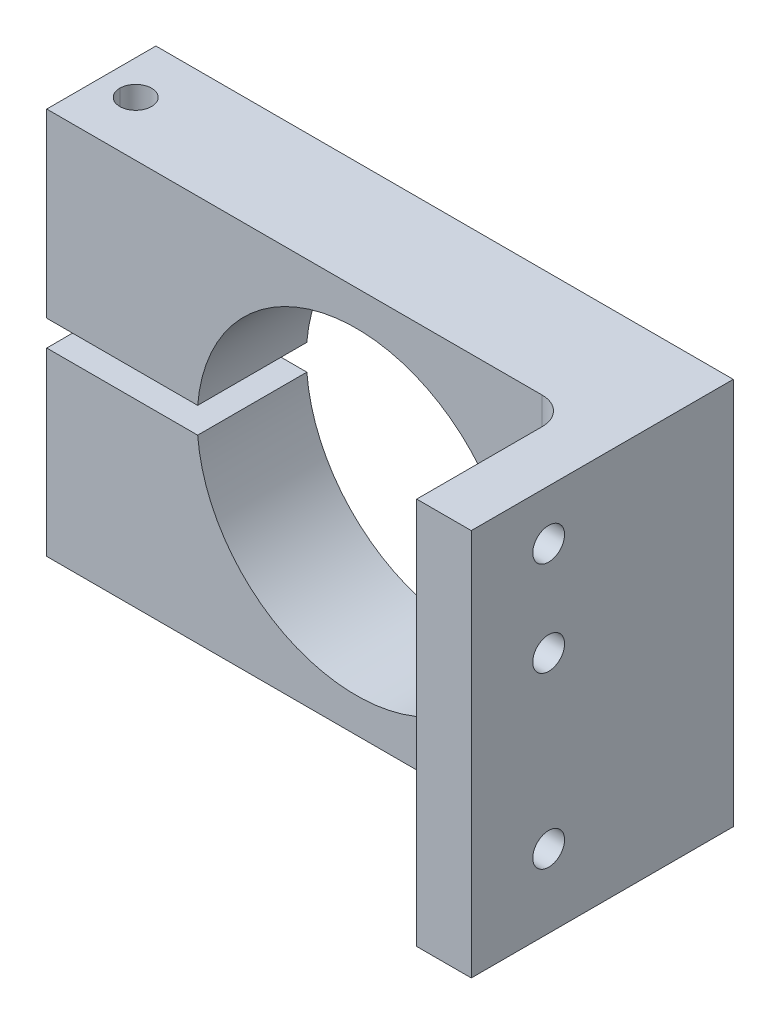
ISO-10303-21;
HEADER;
FILE_DESCRIPTION(('STEP AP214'),'2;1');
FILE_NAME('part.step','',(''),(''),'','','');
FILE_SCHEMA(('AUTOMOTIVE_DESIGN { 1 0 10303 214 1 1 1 1 }'));
ENDSEC;
DATA;
#1=APPLICATION_CONTEXT('core data for automotive mechanical design processes');
#2=APPLICATION_PROTOCOL_DEFINITION('international standard','automotive_design',2000,#1);
#3=PRODUCT_CONTEXT('',#1,'mechanical');
#4=PRODUCT('Part','Part','',(#3));
#5=PRODUCT_RELATED_PRODUCT_CATEGORY('part','',(#4));
#6=PRODUCT_DEFINITION_FORMATION('','',#4);
#7=PRODUCT_DEFINITION_CONTEXT('part definition',#1,'design');
#8=PRODUCT_DEFINITION('design','',#6,#7);
#9=PRODUCT_DEFINITION_SHAPE('','',#8);
#10=(LENGTH_UNIT() NAMED_UNIT(*) SI_UNIT(.MILLI.,.METRE.));
#11=(NAMED_UNIT(*) PLANE_ANGLE_UNIT() SI_UNIT($,.RADIAN.));
#12=(NAMED_UNIT(*) SI_UNIT($,.STERADIAN.) SOLID_ANGLE_UNIT());
#13=UNCERTAINTY_MEASURE_WITH_UNIT(LENGTH_MEASURE(1.E-05),#10,'distance_accuracy_value','');
#14=(GEOMETRIC_REPRESENTATION_CONTEXT(3) GLOBAL_UNCERTAINTY_ASSIGNED_CONTEXT((#13)) GLOBAL_UNIT_ASSIGNED_CONTEXT((#10,
#11,#12)) REPRESENTATION_CONTEXT('',''));
#15=CARTESIAN_POINT('',(0.,0.,0.));
#16=DIRECTION('',(0.,0.,1.));
#17=DIRECTION('',(1.,0.,0.));
#18=AXIS2_PLACEMENT_3D('',#15,#16,#17);
#19=CARTESIAN_POINT('',(11.1406749455796,0.114084600707214,0.400504127415024));
#20=DIRECTION('',(0.,0.,1.));
#21=DIRECTION('',(1.,0.,0.));
#22=AXIS2_PLACEMENT_3D('',#19,#20,#21);
#23=PLANE('',#22);
#24=DIRECTION('',(1.,0.,0.));
#25=VECTOR('',#24,1.);
#26=CARTESIAN_POINT('',(-24.8593250544204,-22.3859153992928,0.400504127415024));
#27=LINE('',#26,#25);
#28=CARTESIAN_POINT('',(-24.8593250544204,-22.3859153992928,0.400504127415024));
#29=VERTEX_POINT('',#28);
#30=CARTESIAN_POINT('',(32.7896749455796,-22.3859153992928,0.400504127415024));
#31=VERTEX_POINT('',#30);
#32=EDGE_CURVE('E282',#29,#31,#27,.T.);
#33=ORIENTED_EDGE('',*,*,#32,.T.);
#34=DIRECTION('',(0.,1.,0.));
#35=VECTOR('',#34,1.);
#36=CARTESIAN_POINT('',(32.7896749455796,0.114084600707207,0.400504127415024));
#37=LINE('',#36,#35);
#38=CARTESIAN_POINT('',(32.7896749455796,22.6940846007072,0.400504127415025));
#39=VERTEX_POINT('',#38);
#40=EDGE_CURVE('E317',#31,#39,#37,.T.);
#41=ORIENTED_EDGE('',*,*,#40,.T.);
#42=DIRECTION('',(1.,0.,0.));
#43=VECTOR('',#42,1.);
#44=CARTESIAN_POINT('',(-24.8593250544204,22.6940846007072,0.400504127415025));
#45=LINE('',#44,#43);
#46=CARTESIAN_POINT('',(-24.8593250544204,22.6940846007072,0.400504127415025));
#47=VERTEX_POINT('',#46);
#48=EDGE_CURVE('E221',#47,#39,#45,.T.);
#49=ORIENTED_EDGE('',*,*,#48,.F.);
#50=DIRECTION('',(0.,1.,0.));
#51=VECTOR('',#50,1.);
#52=CARTESIAN_POINT('',(-24.8593250544204,1.61408460070721,0.400504127415024));
#53=LINE('',#52,#51);
#54=CARTESIAN_POINT('',(-24.8593250544204,1.61408460070721,0.400504127415024));
#55=VERTEX_POINT('',#54);
#56=EDGE_CURVE('E324',#55,#47,#53,.T.);
#57=ORIENTED_EDGE('',*,*,#56,.F.);
#58=DIRECTION('',(-1.,0.,0.));
#59=VECTOR('',#58,1.);
#60=CARTESIAN_POINT('',(-11.2892247421141,1.61408460070721,0.400504127415024));
#61=LINE('',#60,#59);
#62=CARTESIAN_POINT('',(-7.2984139690062,1.61408460070721,0.400504127415024));
#63=VERTEX_POINT('',#62);
#64=EDGE_CURVE('E276',#63,#55,#61,.T.);
#65=ORIENTED_EDGE('',*,*,#64,.F.);
#66=CARTESIAN_POINT('',(11.1406749455796,0.114084600707214,0.400504127415024));
#67=DIRECTION('',(0.,0.,1.));
#68=DIRECTION('',(1.,0.,0.));
#69=AXIS2_PLACEMENT_3D('',#66,#67,#68);
#70=CIRCLE('',#69,18.5);
#71=CARTESIAN_POINT('',(29.6406749455796,0.114084600707214,0.400504127415024));
#72=VERTEX_POINT('',#71);
#73=EDGE_CURVE('E286',#72,#63,#70,.T.);
#74=ORIENTED_EDGE('',*,*,#73,.F.);
#75=CARTESIAN_POINT('',(11.1406749455796,0.114084600707214,0.400504127415024));
#76=DIRECTION('',(0.,0.,1.));
#77=DIRECTION('',(1.,0.,0.));
#78=AXIS2_PLACEMENT_3D('',#75,#76,#77);
#79=CIRCLE('',#78,18.5);
#80=CARTESIAN_POINT('',(-7.29841396900619,-1.38591539929284,0.400504127415024));
#81=VERTEX_POINT('',#80);
#82=EDGE_CURVE('E336',#81,#72,#79,.T.);
#83=ORIENTED_EDGE('',*,*,#82,.F.);
#84=DIRECTION('',(-1.,0.,0.));
#85=VECTOR('',#84,1.);
#86=CARTESIAN_POINT('',(-11.2892247421141,-1.38591539929279,0.400504127415024));
#87=LINE('',#86,#85);
#88=CARTESIAN_POINT('',(-24.8593250544204,-1.38591539929279,0.400504127415024));
#89=VERTEX_POINT('',#88);
#90=EDGE_CURVE('E281',#81,#89,#87,.T.);
#91=ORIENTED_EDGE('',*,*,#90,.T.);
#92=DIRECTION('',(0.,-1.,0.));
#93=VECTOR('',#92,1.);
#94=CARTESIAN_POINT('',(-24.8593250544204,-1.38591539929279,0.400504127415024));
#95=LINE('',#94,#93);
#96=EDGE_CURVE('E277',#89,#29,#95,.T.);
#97=ORIENTED_EDGE('',*,*,#96,.T.);
#98=EDGE_LOOP('',(#33,#41,#49,#57,#65,#74,#83,#91,#97));
#99=FACE_BOUND('',#98,.T.);
#100=ADVANCED_FACE('F66',(#99),#23,.T.);
#101=CARTESIAN_POINT('',(-24.8593250544204,-22.3859153992928,-12.299495872585));
#102=DIRECTION('',(0.,-1.,0.));
#103=DIRECTION('',(0.,0.,-1.));
#104=AXIS2_PLACEMENT_3D('',#101,#102,#103);
#105=PLANE('',#104);
#106=DIRECTION('',(0.,0.,-1.));
#107=VECTOR('',#106,1.);
#108=CARTESIAN_POINT('',(35.9646749455796,-22.3859153992928,-12.299495872585));
#109=LINE('',#108,#107);
#110=CARTESIAN_POINT('',(35.9646749455796,-22.3859153992928,18.180504127415));
#111=VERTEX_POINT('',#110);
#112=CARTESIAN_POINT('',(35.9646749455796,-22.3859153992928,3.57550412741502));
#113=VERTEX_POINT('',#112);
#114=EDGE_CURVE('E205',#111,#113,#109,.T.);
#115=ORIENTED_EDGE('',*,*,#114,.T.);
#116=CARTESIAN_POINT('',(32.7896749455796,-22.3859153992928,3.57550412741502));
#117=DIRECTION('',(0.,-1.,0.));
#118=DIRECTION('',(0.,0.,-1.));
#119=AXIS2_PLACEMENT_3D('',#116,#117,#118);
#120=CIRCLE('',#119,3.175);
#121=EDGE_CURVE('E12',#113,#31,#120,.F.);
#122=ORIENTED_EDGE('',*,*,#121,.T.);
#123=ORIENTED_EDGE('',*,*,#32,.F.);
#124=DIRECTION('',(0.,0.,1.));
#125=VECTOR('',#124,1.);
#126=CARTESIAN_POINT('',(-24.8593250544204,-22.3859153992928,-12.299495872585));
#127=LINE('',#126,#125);
#128=CARTESIAN_POINT('',(-24.8593250544204,-22.3859153992928,-12.299495872585));
#129=VERTEX_POINT('',#128);
#130=EDGE_CURVE('E323',#129,#29,#127,.T.);
#131=ORIENTED_EDGE('',*,*,#130,.F.);
#132=DIRECTION('',(1.,0.,0.));
#133=VECTOR('',#132,1.);
#134=CARTESIAN_POINT('',(-24.8593250544204,-22.3859153992928,-12.299495872585));
#135=LINE('',#134,#133);
#136=CARTESIAN_POINT('',(42.3146749455796,-22.3859153992928,-12.299495872585));
#137=VERTEX_POINT('',#136);
#138=EDGE_CURVE('E332',#129,#137,#135,.T.);
#139=ORIENTED_EDGE('',*,*,#138,.T.);
#140=DIRECTION('',(0.,0.,1.));
#141=VECTOR('',#140,1.);
#142=CARTESIAN_POINT('',(42.3146749455796,-22.3859153992928,-12.299495872585));
#143=LINE('',#142,#141);
#144=CARTESIAN_POINT('',(42.3146749455796,-22.3859153992928,18.180504127415));
#145=VERTEX_POINT('',#144);
#146=EDGE_CURVE('E253',#137,#145,#143,.T.);
#147=ORIENTED_EDGE('',*,*,#146,.T.);
#148=DIRECTION('',(1.,0.,0.));
#149=VECTOR('',#148,1.);
#150=CARTESIAN_POINT('',(35.9646749455796,-22.3859153992928,18.180504127415));
#151=LINE('',#150,#149);
#152=EDGE_CURVE('E249',#111,#145,#151,.T.);
#153=ORIENTED_EDGE('',*,*,#152,.F.);
#154=EDGE_LOOP('',(#115,#122,#123,#131,#139,#147,#153));
#155=FACE_BOUND('',#154,.T.);
#156=CARTESIAN_POINT('',(-20.8593250544204,-22.3859153992928,-5.94949587258498));
#157=DIRECTION('',(0.,1.,0.));
#158=DIRECTION('',(-1.,0.,0.));
#159=AXIS2_PLACEMENT_3D('',#156,#157,#158);
#160=CIRCLE('',#159,1.85);
#161=CARTESIAN_POINT('',(-22.7093250544205,-22.3859153992928,-5.94949587258498));
#162=VERTEX_POINT('',#161);
#163=CARTESIAN_POINT('',(-19.0093250544205,-22.3859153992928,-5.94949587258498));
#164=VERTEX_POINT('',#163);
#165=EDGE_CURVE('E328',#162,#164,#160,.T.);
#166=ORIENTED_EDGE('',*,*,#165,.T.);
#167=CARTESIAN_POINT('',(-20.8593250544204,-22.3859153992928,-5.94949587258498));
#168=DIRECTION('',(0.,1.,0.));
#169=DIRECTION('',(-1.,0.,0.));
#170=AXIS2_PLACEMENT_3D('',#167,#168,#169);
#171=CIRCLE('',#170,1.85);
#172=EDGE_CURVE('E322',#164,#162,#171,.T.);
#173=ORIENTED_EDGE('',*,*,#172,.T.);
#174=EDGE_LOOP('',(#166,#173));
#175=FACE_BOUND('',#174,.T.);
#176=ADVANCED_FACE('F407',(#155,#175),#105,.T.);
#177=CARTESIAN_POINT('',(11.1406749455796,0.114084600707214,-12.299495872585));
#178=DIRECTION('',(0.,0.,1.));
#179=DIRECTION('',(1.,0.,0.));
#180=AXIS2_PLACEMENT_3D('',#177,#178,#179);
#181=PLANE('',#180);
#182=DIRECTION('',(-1.,0.,0.));
#183=VECTOR('',#182,1.);
#184=CARTESIAN_POINT('',(-24.8593250544204,22.6940846007072,-12.299495872585));
#185=LINE('',#184,#183);
#186=CARTESIAN_POINT('',(42.3146749455796,22.6940846007072,-12.299495872585));
#187=VERTEX_POINT('',#186);
#188=CARTESIAN_POINT('',(-24.8593250544204,22.6940846007072,-12.299495872585));
#189=VERTEX_POINT('',#188);
#190=EDGE_CURVE('E222',#187,#189,#185,.T.);
#191=ORIENTED_EDGE('',*,*,#190,.F.);
#192=DIRECTION('',(0.,1.,0.));
#193=VECTOR('',#192,1.);
#194=CARTESIAN_POINT('',(42.3146749455796,0.114084600707206,-12.299495872585));
#195=LINE('',#194,#193);
#196=EDGE_CURVE('E252',#137,#187,#195,.T.);
#197=ORIENTED_EDGE('',*,*,#196,.F.);
#198=ORIENTED_EDGE('',*,*,#138,.F.);
#199=DIRECTION('',(0.,-1.,0.));
#200=VECTOR('',#199,1.);
#201=CARTESIAN_POINT('',(-24.8593250544204,-1.38591539929279,-12.299495872585));
#202=LINE('',#201,#200);
#203=CARTESIAN_POINT('',(-24.8593250544204,-1.38591539929279,-12.299495872585));
#204=VERTEX_POINT('',#203);
#205=EDGE_CURVE('E318',#204,#129,#202,.T.);
#206=ORIENTED_EDGE('',*,*,#205,.F.);
#207=DIRECTION('',(-1.,0.,0.));
#208=VECTOR('',#207,1.);
#209=CARTESIAN_POINT('',(-11.2892247421141,-1.38591539929279,-12.299495872585));
#210=LINE('',#209,#208);
#211=CARTESIAN_POINT('',(-7.29841396900619,-1.38591539929279,-12.299495872585));
#212=VERTEX_POINT('',#211);
#213=EDGE_CURVE('E290',#212,#204,#210,.T.);
#214=ORIENTED_EDGE('',*,*,#213,.F.);
#215=CARTESIAN_POINT('',(11.1406749455796,0.114084600707214,-12.299495872585));
#216=DIRECTION('',(0.,0.,1.));
#217=DIRECTION('',(1.,0.,0.));
#218=AXIS2_PLACEMENT_3D('',#215,#216,#217);
#219=CIRCLE('',#218,18.5);
#220=CARTESIAN_POINT('',(29.6406749455796,0.114084600707214,-12.299495872585));
#221=VERTEX_POINT('',#220);
#222=EDGE_CURVE('E267',#212,#221,#219,.T.);
#223=ORIENTED_EDGE('',*,*,#222,.T.);
#224=CARTESIAN_POINT('',(11.1406749455796,0.114084600707214,-12.299495872585));
#225=DIRECTION('',(0.,0.,1.));
#226=DIRECTION('',(1.,0.,0.));
#227=AXIS2_PLACEMENT_3D('',#224,#225,#226);
#228=CIRCLE('',#227,18.5);
#229=CARTESIAN_POINT('',(-7.2984139690062,1.61408460070722,-12.299495872585));
#230=VERTEX_POINT('',#229);
#231=EDGE_CURVE('E291',#221,#230,#228,.T.);
#232=ORIENTED_EDGE('',*,*,#231,.T.);
#233=DIRECTION('',(-1.,0.,0.));
#234=VECTOR('',#233,1.);
#235=CARTESIAN_POINT('',(-11.2892247421141,1.61408460070721,-12.299495872585));
#236=LINE('',#235,#234);
#237=CARTESIAN_POINT('',(-24.8593250544204,1.61408460070721,-12.299495872585));
#238=VERTEX_POINT('',#237);
#239=EDGE_CURVE('E294',#230,#238,#236,.T.);
#240=ORIENTED_EDGE('',*,*,#239,.T.);
#241=DIRECTION('',(0.,1.,0.));
#242=VECTOR('',#241,1.);
#243=CARTESIAN_POINT('',(-24.8593250544204,1.61408460070721,-12.299495872585));
#244=LINE('',#243,#242);
#245=EDGE_CURVE('E263',#238,#189,#244,.T.);
#246=ORIENTED_EDGE('',*,*,#245,.T.);
#247=EDGE_LOOP('',(#191,#197,#198,#206,#214,#223,#232,#240,#246));
#248=FACE_BOUND('',#247,.T.);
#249=ADVANCED_FACE('F403',(#248),#181,.F.);
#250=CARTESIAN_POINT('',(-20.8593250544204,-22.3859153992928,-5.94949587258498));
#251=DIRECTION('',(0.,1.,0.));
#252=DIRECTION('',(-1.,0.,0.));
#253=AXIS2_PLACEMENT_3D('',#250,#251,#252);
#254=CYLINDRICAL_SURFACE('',#253,1.85);
#255=CARTESIAN_POINT('',(-20.8593250544204,1.61408460070721,-5.94949587258498));
#256=DIRECTION('',(0.,1.,0.));
#257=DIRECTION('',(-1.,0.,0.));
#258=AXIS2_PLACEMENT_3D('',#255,#256,#257);
#259=CIRCLE('',#258,1.85);
#260=CARTESIAN_POINT('',(-19.0093250544205,1.61408460070721,-5.94949587258498));
#261=VERTEX_POINT('',#260);
#262=CARTESIAN_POINT('',(-22.7093250544205,1.61408460070721,-5.94949587258498));
#263=VERTEX_POINT('',#262);
#264=EDGE_CURVE('E262',#261,#263,#259,.T.);
#265=ORIENTED_EDGE('',*,*,#264,.F.);
#266=DIRECTION('',(0.,1.,0.));
#267=VECTOR('',#266,1.);
#268=CARTESIAN_POINT('',(-19.0093250544205,-22.3859153992928,-5.94949587258498));
#269=LINE('',#268,#267);
#270=CARTESIAN_POINT('',(-19.0093250544204,22.6940846007072,-5.94949587258498));
#271=VERTEX_POINT('',#270);
#272=EDGE_CURVE('E272',#261,#271,#269,.T.);
#273=ORIENTED_EDGE('',*,*,#272,.T.);
#274=CARTESIAN_POINT('',(-20.8593250544204,22.6940846007072,-5.94949587258498));
#275=DIRECTION('',(0.,1.,0.));
#276=DIRECTION('',(-1.,0.,0.));
#277=AXIS2_PLACEMENT_3D('',#274,#275,#276);
#278=CIRCLE('',#277,1.85000000000002);
#279=CARTESIAN_POINT('',(-22.7093250544205,22.6940846007072,-5.94949587258498));
#280=VERTEX_POINT('',#279);
#281=EDGE_CURVE('E216',#271,#280,#278,.T.);
#282=ORIENTED_EDGE('',*,*,#281,.T.);
#283=DIRECTION('',(0.,1.,0.));
#284=VECTOR('',#283,1.);
#285=CARTESIAN_POINT('',(-22.7093250544205,-22.3859153992928,-5.94949587258498));
#286=LINE('',#285,#284);
#287=EDGE_CURVE('E255',#263,#280,#286,.T.);
#288=ORIENTED_EDGE('',*,*,#287,.F.);
#289=EDGE_LOOP('',(#265,#273,#282,#288));
#290=FACE_BOUND('',#289,.T.);
#291=ADVANCED_FACE('F459',(#290),#254,.F.);
#292=CARTESIAN_POINT('',(-20.8593250544204,-22.3859153992928,-5.94949587258498));
#293=DIRECTION('',(0.,1.,0.));
#294=DIRECTION('',(-1.,0.,0.));
#295=AXIS2_PLACEMENT_3D('',#292,#293,#294);
#296=CYLINDRICAL_SURFACE('',#295,1.85);
#297=ORIENTED_EDGE('',*,*,#172,.F.);
#298=DIRECTION('',(0.,1.,0.));
#299=VECTOR('',#298,1.);
#300=CARTESIAN_POINT('',(-19.0093250544205,-22.3859153992928,-5.94949587258498));
#301=LINE('',#300,#299);
#302=CARTESIAN_POINT('',(-19.0093250544205,-1.38591539929279,-5.94949587258498));
#303=VERTEX_POINT('',#302);
#304=EDGE_CURVE('E268',#164,#303,#301,.T.);
#305=ORIENTED_EDGE('',*,*,#304,.T.);
#306=CARTESIAN_POINT('',(-20.8593250544204,-1.38591539929279,-5.94949587258498));
#307=DIRECTION('',(0.,1.,0.));
#308=DIRECTION('',(-1.,0.,0.));
#309=AXIS2_PLACEMENT_3D('',#306,#307,#308);
#310=CIRCLE('',#309,1.85);
#311=CARTESIAN_POINT('',(-22.7093250544205,-1.38591539929279,-5.94949587258498));
#312=VERTEX_POINT('',#311);
#313=EDGE_CURVE('E273',#303,#312,#310,.T.);
#314=ORIENTED_EDGE('',*,*,#313,.T.);
#315=DIRECTION('',(0.,1.,0.));
#316=VECTOR('',#315,1.);
#317=CARTESIAN_POINT('',(-22.7093250544205,-22.3859153992928,-5.94949587258498));
#318=LINE('',#317,#316);
#319=EDGE_CURVE('E301',#162,#312,#318,.T.);
#320=ORIENTED_EDGE('',*,*,#319,.F.);
#321=EDGE_LOOP('',(#297,#305,#314,#320));
#322=FACE_BOUND('',#321,.T.);
#323=ADVANCED_FACE('F448',(#322),#296,.F.);
#324=CARTESIAN_POINT('',(11.1406749455796,0.114084600707214,-12.299495872585));
#325=DIRECTION('',(0.,0.,1.));
#326=DIRECTION('',(1.,0.,0.));
#327=AXIS2_PLACEMENT_3D('',#324,#325,#326);
#328=CYLINDRICAL_SURFACE('',#327,18.5);
#329=ORIENTED_EDGE('',*,*,#231,.F.);
#330=DIRECTION('',(0.,0.,1.));
#331=VECTOR('',#330,1.);
#332=CARTESIAN_POINT('',(29.6406749455796,0.114084600707214,-12.299495872585));
#333=LINE('',#332,#331);
#334=EDGE_CURVE('E305',#221,#72,#333,.T.);
#335=ORIENTED_EDGE('',*,*,#334,.T.);
#336=ORIENTED_EDGE('',*,*,#73,.T.);
#337=DIRECTION('',(0.,0.,1.));
#338=VECTOR('',#337,1.);
#339=CARTESIAN_POINT('',(-7.2984139690062,1.61408460070721,-12.299495872585));
#340=LINE('',#339,#338);
#341=EDGE_CURVE('E261',#230,#63,#340,.T.);
#342=ORIENTED_EDGE('',*,*,#341,.F.);
#343=EDGE_LOOP('',(#329,#335,#336,#342));
#344=FACE_BOUND('',#343,.T.);
#345=ADVANCED_FACE('F388',(#344),#328,.F.);
#346=CARTESIAN_POINT('',(-11.2892247421141,1.61408460070721,-12.299495872585));
#347=DIRECTION('',(0.,1.,0.));
#348=DIRECTION('',(1.,0.,0.));
#349=AXIS2_PLACEMENT_3D('',#346,#347,#348);
#350=PLANE('',#349);
#351=ORIENTED_EDGE('',*,*,#64,.T.);
#352=DIRECTION('',(0.,0.,1.));
#353=VECTOR('',#352,1.);
#354=CARTESIAN_POINT('',(-24.8593250544204,1.61408460070721,-12.299495872585));
#355=LINE('',#354,#353);
#356=EDGE_CURVE('E327',#238,#55,#355,.T.);
#357=ORIENTED_EDGE('',*,*,#356,.F.);
#358=ORIENTED_EDGE('',*,*,#239,.F.);
#359=ORIENTED_EDGE('',*,*,#341,.T.);
#360=EDGE_LOOP('',(#351,#357,#358,#359));
#361=FACE_BOUND('',#360,.T.);
#362=CARTESIAN_POINT('',(-20.8593250544204,1.61408460070721,-5.94949587258498));
#363=DIRECTION('',(0.,1.,0.));
#364=DIRECTION('',(-1.,0.,0.));
#365=AXIS2_PLACEMENT_3D('',#362,#363,#364);
#366=CIRCLE('',#365,1.85);
#367=EDGE_CURVE('E257',#263,#261,#366,.T.);
#368=ORIENTED_EDGE('',*,*,#367,.T.);
#369=ORIENTED_EDGE('',*,*,#264,.T.);
#370=EDGE_LOOP('',(#368,#369));
#371=FACE_BOUND('',#370,.T.);
#372=ADVANCED_FACE('F383',(#361,#371),#350,.F.);
#373=CARTESIAN_POINT('',(-24.8593250544204,1.61408460070721,-12.299495872585));
#374=DIRECTION('',(1.,0.,0.));
#375=DIRECTION('',(0.,1.,0.));
#376=AXIS2_PLACEMENT_3D('',#373,#374,#375);
#377=PLANE('',#376);
#378=ORIENTED_EDGE('',*,*,#56,.T.);
#379=DIRECTION('',(0.,0.,1.));
#380=VECTOR('',#379,1.);
#381=CARTESIAN_POINT('',(-24.8593250544204,22.6940846007072,-12.299495872585));
#382=LINE('',#381,#380);
#383=EDGE_CURVE('E225',#189,#47,#382,.T.);
#384=ORIENTED_EDGE('',*,*,#383,.F.);
#385=ORIENTED_EDGE('',*,*,#245,.F.);
#386=ORIENTED_EDGE('',*,*,#356,.T.);
#387=EDGE_LOOP('',(#378,#384,#385,#386));
#388=FACE_BOUND('',#387,.T.);
#389=ADVANCED_FACE('F378',(#388),#377,.F.);
#390=CARTESIAN_POINT('',(-24.8593250544204,-1.38591539929279,-12.299495872585));
#391=DIRECTION('',(-1.,0.,0.));
#392=DIRECTION('',(0.,1.,0.));
#393=AXIS2_PLACEMENT_3D('',#390,#391,#392);
#394=PLANE('',#393);
#395=ORIENTED_EDGE('',*,*,#96,.F.);
#396=DIRECTION('',(0.,0.,1.));
#397=VECTOR('',#396,1.);
#398=CARTESIAN_POINT('',(-24.8593250544204,-1.38591539929279,-12.299495872585));
#399=LINE('',#398,#397);
#400=EDGE_CURVE('E266',#204,#89,#399,.T.);
#401=ORIENTED_EDGE('',*,*,#400,.F.);
#402=ORIENTED_EDGE('',*,*,#205,.T.);
#403=ORIENTED_EDGE('',*,*,#130,.T.);
#404=EDGE_LOOP('',(#395,#401,#402,#403));
#405=FACE_BOUND('',#404,.T.);
#406=ADVANCED_FACE('F400',(#405),#394,.T.);
#407=CARTESIAN_POINT('',(-11.2892247421141,-1.38591539929279,-12.299495872585));
#408=DIRECTION('',(0.,1.,0.));
#409=DIRECTION('',(1.,0.,0.));
#410=AXIS2_PLACEMENT_3D('',#407,#408,#409);
#411=PLANE('',#410);
#412=ORIENTED_EDGE('',*,*,#90,.F.);
#413=DIRECTION('',(0.,0.,1.));
#414=VECTOR('',#413,1.);
#415=CARTESIAN_POINT('',(-7.29841396900619,-1.38591539929279,-12.299495872585));
#416=LINE('',#415,#414);
#417=EDGE_CURVE('E340',#212,#81,#416,.T.);
#418=ORIENTED_EDGE('',*,*,#417,.F.);
#419=ORIENTED_EDGE('',*,*,#213,.T.);
#420=ORIENTED_EDGE('',*,*,#400,.T.);
#421=EDGE_LOOP('',(#412,#418,#419,#420));
#422=FACE_BOUND('',#421,.T.);
#423=CARTESIAN_POINT('',(-20.8593250544204,-1.38591539929279,-5.94949587258498));
#424=DIRECTION('',(0.,1.,0.));
#425=DIRECTION('',(-1.,0.,0.));
#426=AXIS2_PLACEMENT_3D('',#423,#424,#425);
#427=CIRCLE('',#426,1.85);
#428=EDGE_CURVE('E297',#312,#303,#427,.T.);
#429=ORIENTED_EDGE('',*,*,#428,.F.);
#430=ORIENTED_EDGE('',*,*,#313,.F.);
#431=EDGE_LOOP('',(#429,#430));
#432=FACE_BOUND('',#431,.T.);
#433=ADVANCED_FACE('F395',(#422,#432),#411,.T.);
#434=CARTESIAN_POINT('',(11.1406749455796,0.114084600707214,-12.299495872585));
#435=DIRECTION('',(0.,0.,1.));
#436=DIRECTION('',(1.,0.,0.));
#437=AXIS2_PLACEMENT_3D('',#434,#435,#436);
#438=CYLINDRICAL_SURFACE('',#437,18.5);
#439=ORIENTED_EDGE('',*,*,#334,.F.);
#440=ORIENTED_EDGE('',*,*,#222,.F.);
#441=ORIENTED_EDGE('',*,*,#417,.T.);
#442=ORIENTED_EDGE('',*,*,#82,.T.);
#443=EDGE_LOOP('',(#439,#440,#441,#442));
#444=FACE_BOUND('',#443,.T.);
#445=ADVANCED_FACE('F392',(#444),#438,.F.);
#446=CARTESIAN_POINT('',(-20.8593250544204,-22.3859153992928,-5.94949587258498));
#447=DIRECTION('',(0.,1.,0.));
#448=DIRECTION('',(-1.,0.,0.));
#449=AXIS2_PLACEMENT_3D('',#446,#447,#448);
#450=CYLINDRICAL_SURFACE('',#449,1.85);
#451=ORIENTED_EDGE('',*,*,#304,.F.);
#452=ORIENTED_EDGE('',*,*,#165,.F.);
#453=ORIENTED_EDGE('',*,*,#319,.T.);
#454=ORIENTED_EDGE('',*,*,#428,.T.);
#455=EDGE_LOOP('',(#451,#452,#453,#454));
#456=FACE_BOUND('',#455,.T.);
#457=ADVANCED_FACE('F453',(#456),#450,.F.);
#458=CARTESIAN_POINT('',(-20.8593250544204,-22.3859153992928,-5.94949587258498));
#459=DIRECTION('',(0.,1.,0.));
#460=DIRECTION('',(-1.,0.,0.));
#461=AXIS2_PLACEMENT_3D('',#458,#459,#460);
#462=CYLINDRICAL_SURFACE('',#461,1.85);
#463=ORIENTED_EDGE('',*,*,#272,.F.);
#464=ORIENTED_EDGE('',*,*,#367,.F.);
#465=ORIENTED_EDGE('',*,*,#287,.T.);
#466=CARTESIAN_POINT('',(-20.8593250544204,22.6940846007072,-5.94949587258498));
#467=DIRECTION('',(0.,1.,0.));
#468=DIRECTION('',(-1.,0.,0.));
#469=AXIS2_PLACEMENT_3D('',#466,#467,#468);
#470=CIRCLE('',#469,1.85000000000002);
#471=EDGE_CURVE('E213',#280,#271,#470,.T.);
#472=ORIENTED_EDGE('',*,*,#471,.T.);
#473=EDGE_LOOP('',(#463,#464,#465,#472));
#474=FACE_BOUND('',#473,.T.);
#475=ADVANCED_FACE('F413',(#474),#462,.F.);
#476=CARTESIAN_POINT('',(42.3146749455796,0.,0.));
#477=DIRECTION('',(1.,0.,0.));
#478=DIRECTION('',(0.,1.,0.));
#479=AXIS2_PLACEMENT_3D('',#476,#477,#478);
#480=PLANE('',#479);
#481=DIRECTION('',(0.,0.,-1.));
#482=VECTOR('',#481,1.);
#483=CARTESIAN_POINT('',(42.3146749455796,22.6940846007072,-12.299495872585));
#484=LINE('',#483,#482);
#485=CARTESIAN_POINT('',(42.3146749455796,22.6940846007072,18.180504127415));
#486=VERTEX_POINT('',#485);
#487=EDGE_CURVE('E219',#486,#187,#484,.T.);
#488=ORIENTED_EDGE('',*,*,#487,.F.);
#489=DIRECTION('',(0.,-1.,0.));
#490=VECTOR('',#489,1.);
#491=CARTESIAN_POINT('',(42.3146749455796,-22.3859153992928,18.180504127415));
#492=LINE('',#491,#490);
#493=EDGE_CURVE('E208',#486,#145,#492,.T.);
#494=ORIENTED_EDGE('',*,*,#493,.T.);
#495=ORIENTED_EDGE('',*,*,#146,.F.);
#496=ORIENTED_EDGE('',*,*,#196,.T.);
#497=EDGE_LOOP('',(#488,#494,#495,#496));
#498=FACE_BOUND('',#497,.T.);
#499=CARTESIAN_POINT('',(42.3146749455796,16.8692598826912,9.17700259117283));
#500=DIRECTION('',(1.,0.,0.));
#501=DIRECTION('',(0.,1.,0.));
#502=AXIS2_PLACEMENT_3D('',#499,#500,#501);
#503=CIRCLE('',#502,1.85);
#504=CARTESIAN_POINT('',(42.3146749455796,18.7192598826913,9.17700259117283));
#505=VERTEX_POINT('',#504);
#506=EDGE_CURVE('E234',#505,#505,#503,.F.);
#507=ORIENTED_EDGE('',*,*,#506,.T.);
#508=EDGE_LOOP('',(#507));
#509=FACE_BOUND('',#508,.T.);
#510=CARTESIAN_POINT('',(42.3146749455796,5.86367435841275,9.17700259117284));
#511=DIRECTION('',(1.,0.,0.));
#512=DIRECTION('',(0.,1.,0.));
#513=AXIS2_PLACEMENT_3D('',#510,#511,#512);
#514=CIRCLE('',#513,1.85);
#515=CARTESIAN_POINT('',(42.3146749455796,7.71367435841275,9.17700259117284));
#516=VERTEX_POINT('',#515);
#517=EDGE_CURVE('E240',#516,#516,#514,.F.);
#518=ORIENTED_EDGE('',*,*,#517,.T.);
#519=EDGE_LOOP('',(#518));
#520=FACE_BOUND('',#519,.T.);
#521=CARTESIAN_POINT('',(42.3146749455796,-13.8730090151267,9.17700259117284));
#522=DIRECTION('',(1.,0.,0.));
#523=DIRECTION('',(0.,1.,0.));
#524=AXIS2_PLACEMENT_3D('',#521,#522,#523);
#525=CIRCLE('',#524,1.85);
#526=CARTESIAN_POINT('',(42.3146749455796,-12.0230090151267,9.17700259117284));
#527=VERTEX_POINT('',#526);
#528=EDGE_CURVE('E227',#527,#527,#525,.F.);
#529=ORIENTED_EDGE('',*,*,#528,.T.);
#530=EDGE_LOOP('',(#529));
#531=FACE_BOUND('',#530,.T.);
#532=ADVANCED_FACE('F410',(#498,#509,#520,#531),#480,.T.);
#533=CARTESIAN_POINT('',(35.9646749455796,-22.3859153992928,18.180504127415));
#534=DIRECTION('',(0.,0.,1.));
#535=DIRECTION('',(1.,0.,0.));
#536=AXIS2_PLACEMENT_3D('',#533,#534,#535);
#537=PLANE('',#536);
#538=ORIENTED_EDGE('',*,*,#493,.F.);
#539=DIRECTION('',(1.,0.,0.));
#540=VECTOR('',#539,1.);
#541=CARTESIAN_POINT('',(35.9646749455796,22.6940846007072,18.180504127415));
#542=LINE('',#541,#540);
#543=CARTESIAN_POINT('',(35.9646749455796,22.6940846007072,18.180504127415));
#544=VERTEX_POINT('',#543);
#545=EDGE_CURVE('E200',#544,#486,#542,.T.);
#546=ORIENTED_EDGE('',*,*,#545,.F.);
#547=DIRECTION('',(0.,-1.,0.));
#548=VECTOR('',#547,1.);
#549=CARTESIAN_POINT('',(35.9646749455796,-22.3859153992928,18.180504127415));
#550=LINE('',#549,#548);
#551=EDGE_CURVE('E203',#544,#111,#550,.T.);
#552=ORIENTED_EDGE('',*,*,#551,.T.);
#553=ORIENTED_EDGE('',*,*,#152,.T.);
#554=EDGE_LOOP('',(#538,#546,#552,#553));
#555=FACE_BOUND('',#554,.T.);
#556=ADVANCED_FACE('F210',(#555),#537,.T.);
#557=CARTESIAN_POINT('',(35.9646749455796,0.,0.));
#558=DIRECTION('',(1.,0.,0.));
#559=DIRECTION('',(0.,1.,0.));
#560=AXIS2_PLACEMENT_3D('',#557,#558,#559);
#561=PLANE('',#560);
#562=CARTESIAN_POINT('',(35.9646749455796,16.8692598826913,9.17700259117283));
#563=DIRECTION('',(-1.,0.,0.));
#564=DIRECTION('',(0.,-1.,0.));
#565=AXIS2_PLACEMENT_3D('',#562,#563,#564);
#566=CIRCLE('',#565,1.85);
#567=CARTESIAN_POINT('',(35.9646749455796,15.0192598826913,9.17700259117283));
#568=VERTEX_POINT('',#567);
#569=EDGE_CURVE('E231',#568,#568,#566,.T.);
#570=ORIENTED_EDGE('',*,*,#569,.F.);
#571=EDGE_LOOP('',(#570));
#572=FACE_BOUND('',#571,.T.);
#573=CARTESIAN_POINT('',(35.9646749455796,5.86367435841275,9.17700259117284));
#574=DIRECTION('',(-1.,0.,0.));
#575=DIRECTION('',(0.,-1.,0.));
#576=AXIS2_PLACEMENT_3D('',#573,#574,#575);
#577=CIRCLE('',#576,1.85);
#578=CARTESIAN_POINT('',(35.9646749455796,4.01367435841275,9.17700259117284));
#579=VERTEX_POINT('',#578);
#580=EDGE_CURVE('E237',#579,#579,#577,.T.);
#581=ORIENTED_EDGE('',*,*,#580,.F.);
#582=EDGE_LOOP('',(#581));
#583=FACE_BOUND('',#582,.T.);
#584=CARTESIAN_POINT('',(35.9646749455796,-13.8730090151267,9.17700259117284));
#585=DIRECTION('',(-1.,0.,0.));
#586=DIRECTION('',(0.,-1.,0.));
#587=AXIS2_PLACEMENT_3D('',#584,#585,#586);
#588=CIRCLE('',#587,1.85);
#589=CARTESIAN_POINT('',(35.9646749455796,-15.7230090151267,9.17700259117284));
#590=VERTEX_POINT('',#589);
#591=EDGE_CURVE('E243',#590,#590,#588,.T.);
#592=ORIENTED_EDGE('',*,*,#591,.F.);
#593=EDGE_LOOP('',(#592));
#594=FACE_BOUND('',#593,.T.);
#595=DIRECTION('',(0.,0.,1.));
#596=VECTOR('',#595,1.);
#597=CARTESIAN_POINT('',(35.9646749455796,22.6940846007072,0.400504127415025));
#598=LINE('',#597,#596);
#599=CARTESIAN_POINT('',(35.9646749455796,22.6940846007072,3.57550412741502));
#600=VERTEX_POINT('',#599);
#601=EDGE_CURVE('E194',#600,#544,#598,.T.);
#602=ORIENTED_EDGE('',*,*,#601,.F.);
#603=DIRECTION('',(0.,1.,0.));
#604=VECTOR('',#603,1.);
#605=CARTESIAN_POINT('',(35.9646749455796,0.,3.57550412741502));
#606=LINE('',#605,#604);
#607=EDGE_CURVE('E81',#600,#113,#606,.F.);
#608=ORIENTED_EDGE('',*,*,#607,.T.);
#609=ORIENTED_EDGE('',*,*,#114,.F.);
#610=ORIENTED_EDGE('',*,*,#551,.F.);
#611=EDGE_LOOP('',(#602,#608,#609,#610));
#612=FACE_BOUND('',#611,.T.);
#613=ADVANCED_FACE('F204',(#572,#583,#594,#612),#561,.F.);
#614=CARTESIAN_POINT('',(42.3156749455796,-13.8730090151267,9.17700259117284));
#615=DIRECTION('',(-1.,0.,0.));
#616=DIRECTION('',(0.,-1.,0.));
#617=AXIS2_PLACEMENT_3D('',#614,#615,#616);
#618=CYLINDRICAL_SURFACE('',#617,1.85);
#619=ORIENTED_EDGE('',*,*,#528,.F.);
#620=EDGE_LOOP('',(#619));
#621=FACE_BOUND('',#620,.T.);
#622=ORIENTED_EDGE('',*,*,#591,.T.);
#623=EDGE_LOOP('',(#622));
#624=FACE_BOUND('',#623,.T.);
#625=ADVANCED_FACE('F421',(#621,#624),#618,.F.);
#626=CARTESIAN_POINT('',(42.3156749455796,5.86367435841275,9.17700259117284));
#627=DIRECTION('',(-1.,0.,0.));
#628=DIRECTION('',(0.,-1.,0.));
#629=AXIS2_PLACEMENT_3D('',#626,#627,#628);
#630=CYLINDRICAL_SURFACE('',#629,1.85);
#631=ORIENTED_EDGE('',*,*,#517,.F.);
#632=EDGE_LOOP('',(#631));
#633=FACE_BOUND('',#632,.T.);
#634=ORIENTED_EDGE('',*,*,#580,.T.);
#635=EDGE_LOOP('',(#634));
#636=FACE_BOUND('',#635,.T.);
#637=ADVANCED_FACE('F424',(#633,#636),#630,.F.);
#638=CARTESIAN_POINT('',(42.3156749455796,16.8692598826912,9.17700259117283));
#639=DIRECTION('',(-1.,0.,0.));
#640=DIRECTION('',(0.,-1.,0.));
#641=AXIS2_PLACEMENT_3D('',#638,#639,#640);
#642=CYLINDRICAL_SURFACE('',#641,1.85);
#643=ORIENTED_EDGE('',*,*,#506,.F.);
#644=EDGE_LOOP('',(#643));
#645=FACE_BOUND('',#644,.T.);
#646=ORIENTED_EDGE('',*,*,#569,.T.);
#647=EDGE_LOOP('',(#646));
#648=FACE_BOUND('',#647,.T.);
#649=ADVANCED_FACE('F537',(#645,#648),#642,.F.);
#650=CARTESIAN_POINT('',(0.,22.6940846007072,0.));
#651=DIRECTION('',(0.,1.,0.));
#652=DIRECTION('',(-1.,0.,0.));
#653=AXIS2_PLACEMENT_3D('',#650,#651,#652);
#654=PLANE('',#653);
#655=ORIENTED_EDGE('',*,*,#471,.F.);
#656=ORIENTED_EDGE('',*,*,#281,.F.);
#657=EDGE_LOOP('',(#655,#656));
#658=FACE_BOUND('',#657,.T.);
#659=ORIENTED_EDGE('',*,*,#383,.T.);
#660=ORIENTED_EDGE('',*,*,#48,.T.);
#661=CARTESIAN_POINT('',(32.7896749455796,22.6940846007072,3.57550412741502));
#662=DIRECTION('',(0.,1.,0.));
#663=DIRECTION('',(-1.,0.,0.));
#664=AXIS2_PLACEMENT_3D('',#661,#662,#663);
#665=CIRCLE('',#664,3.175);
#666=EDGE_CURVE('E74',#39,#600,#665,.F.);
#667=ORIENTED_EDGE('',*,*,#666,.T.);
#668=ORIENTED_EDGE('',*,*,#601,.T.);
#669=ORIENTED_EDGE('',*,*,#545,.T.);
#670=ORIENTED_EDGE('',*,*,#487,.T.);
#671=ORIENTED_EDGE('',*,*,#190,.T.);
#672=EDGE_LOOP('',(#659,#660,#667,#668,#669,#670,#671));
#673=FACE_BOUND('',#672,.T.);
#674=ADVANCED_FACE('F197',(#658,#673),#654,.T.);
#675=CARTESIAN_POINT('',(32.7896749455796,0.114084600707207,3.57550412741502));
#676=DIRECTION('',(0.,1.,0.));
#677=DIRECTION('',(-1.,0.,0.));
#678=AXIS2_PLACEMENT_3D('',#675,#676,#677);
#679=CYLINDRICAL_SURFACE('',#678,3.175);
#680=ORIENTED_EDGE('',*,*,#121,.F.);
#681=ORIENTED_EDGE('',*,*,#607,.F.);
#682=ORIENTED_EDGE('',*,*,#666,.F.);
#683=ORIENTED_EDGE('',*,*,#40,.F.);
#684=EDGE_LOOP('',(#680,#681,#682,#683));
#685=FACE_BOUND('',#684,.T.);
#686=ADVANCED_FACE('F68',(#685),#679,.F.);
#687=CLOSED_SHELL('',(#100,#176,#249,#291,#323,#345,#372,#389,#406,#433,#445,#457,#475,#532,
#556,#613,#625,#637,#649,#674,#686));
#688=MANIFOLD_SOLID_BREP('B2',#687);
#689=ADVANCED_BREP_SHAPE_REPRESENTATION('',(#18,#688),#14);
#690=SHAPE_DEFINITION_REPRESENTATION(#9,#689);
ENDSEC;
END-ISO-10303-21;
